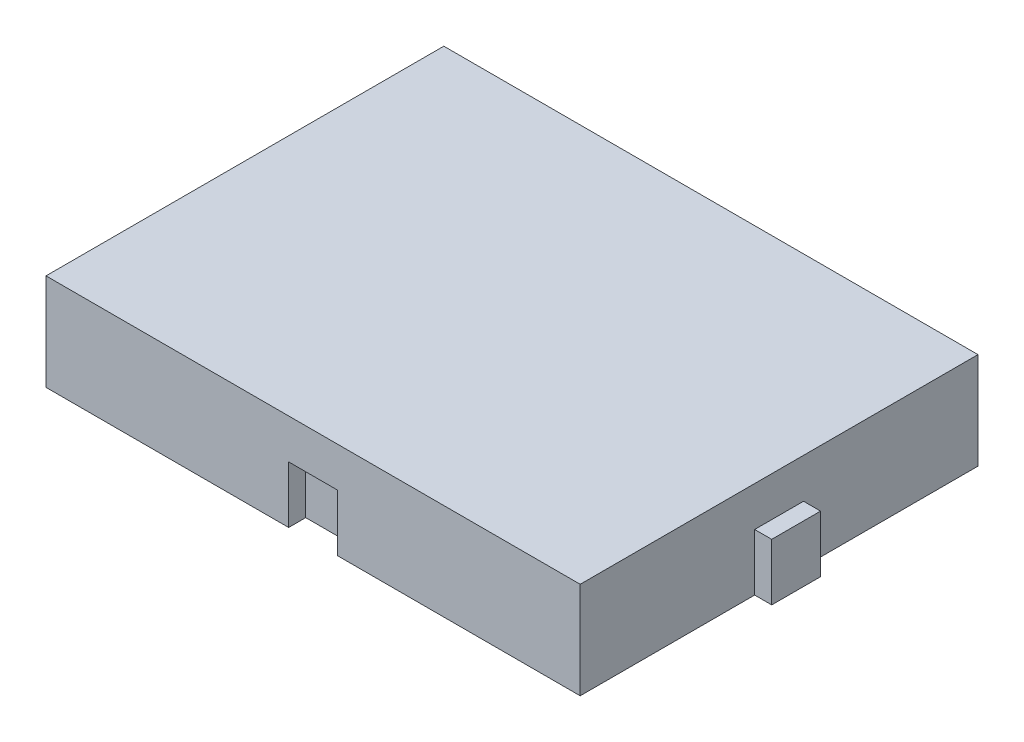
ISO-10303-21;
HEADER;
FILE_DESCRIPTION(('STEP AP214'),'2;1');
FILE_NAME('part.step','',(''),(''),'','','');
FILE_SCHEMA(('AUTOMOTIVE_DESIGN { 1 0 10303 214 1 1 1 1 }'));
ENDSEC;
DATA;
#1=APPLICATION_CONTEXT('core data for automotive mechanical design processes');
#2=APPLICATION_PROTOCOL_DEFINITION('international standard','automotive_design',2000,#1);
#3=PRODUCT_CONTEXT('',#1,'mechanical');
#4=PRODUCT('Part','Part','',(#3));
#5=PRODUCT_RELATED_PRODUCT_CATEGORY('part','',(#4));
#6=PRODUCT_DEFINITION_FORMATION('','',#4);
#7=PRODUCT_DEFINITION_CONTEXT('part definition',#1,'design');
#8=PRODUCT_DEFINITION('design','',#6,#7);
#9=PRODUCT_DEFINITION_SHAPE('','',#8);
#10=(LENGTH_UNIT() NAMED_UNIT(*) SI_UNIT(.MILLI.,.METRE.));
#11=(NAMED_UNIT(*) PLANE_ANGLE_UNIT() SI_UNIT($,.RADIAN.));
#12=(NAMED_UNIT(*) SI_UNIT($,.STERADIAN.) SOLID_ANGLE_UNIT());
#13=UNCERTAINTY_MEASURE_WITH_UNIT(LENGTH_MEASURE(1.E-05),#10,'distance_accuracy_value','');
#14=(GEOMETRIC_REPRESENTATION_CONTEXT(3) GLOBAL_UNCERTAINTY_ASSIGNED_CONTEXT((#13)) GLOBAL_UNIT_ASSIGNED_CONTEXT((#10,
#11,#12)) REPRESENTATION_CONTEXT('',''));
#15=CARTESIAN_POINT('',(0.,0.,0.));
#16=DIRECTION('',(0.,0.,1.));
#17=DIRECTION('',(1.,0.,0.));
#18=AXIS2_PLACEMENT_3D('',#15,#16,#17);
#19=CARTESIAN_POINT('',(23.5,8.5,17.5));
#20=DIRECTION('',(-1.,0.,0.));
#21=DIRECTION('',(0.,0.,1.));
#22=AXIS2_PLACEMENT_3D('',#19,#20,#21);
#23=PLANE('',#22);
#24=DIRECTION('',(0.,-1.,0.));
#25=VECTOR('',#24,1.);
#26=CARTESIAN_POINT('',(23.5,5.,2.15));
#27=LINE('',#26,#25);
#28=CARTESIAN_POINT('',(23.5,5.,2.15));
#29=VERTEX_POINT('',#28);
#30=CARTESIAN_POINT('',(23.5,0.,2.15));
#31=VERTEX_POINT('',#30);
#32=EDGE_CURVE('E258',#29,#31,#27,.T.);
#33=ORIENTED_EDGE('',*,*,#32,.F.);
#34=DIRECTION('',(0.,0.,-1.));
#35=VECTOR('',#34,1.);
#36=CARTESIAN_POINT('',(23.5,5.,2.15));
#37=LINE('',#36,#35);
#38=CARTESIAN_POINT('',(23.5,5.,-2.15));
#39=VERTEX_POINT('',#38);
#40=EDGE_CURVE('E237',#29,#39,#37,.T.);
#41=ORIENTED_EDGE('',*,*,#40,.T.);
#42=DIRECTION('',(0.,-1.,0.));
#43=VECTOR('',#42,1.);
#44=CARTESIAN_POINT('',(23.5,5.,-2.15));
#45=LINE('',#44,#43);
#46=CARTESIAN_POINT('',(23.5,0.,-2.15));
#47=VERTEX_POINT('',#46);
#48=EDGE_CURVE('E250',#39,#47,#45,.T.);
#49=ORIENTED_EDGE('',*,*,#48,.T.);
#50=DIRECTION('',(0.,0.,-1.));
#51=VECTOR('',#50,1.);
#52=CARTESIAN_POINT('',(23.5,0.,17.5));
#53=LINE('',#52,#51);
#54=CARTESIAN_POINT('',(23.5,0.,-17.5));
#55=VERTEX_POINT('',#54);
#56=EDGE_CURVE('E290',#47,#55,#53,.T.);
#57=ORIENTED_EDGE('',*,*,#56,.T.);
#58=DIRECTION('',(0.,-1.,0.));
#59=VECTOR('',#58,1.);
#60=CARTESIAN_POINT('',(23.5,8.5,-17.5));
#61=LINE('',#60,#59);
#62=CARTESIAN_POINT('',(23.5,8.5,-17.5));
#63=VERTEX_POINT('',#62);
#64=EDGE_CURVE('E11',#63,#55,#61,.T.);
#65=ORIENTED_EDGE('',*,*,#64,.F.);
#66=DIRECTION('',(0.,0.,-1.));
#67=VECTOR('',#66,1.);
#68=CARTESIAN_POINT('',(23.5,8.5,17.5));
#69=LINE('',#68,#67);
#70=CARTESIAN_POINT('',(23.5,8.5,17.5));
#71=VERTEX_POINT('',#70);
#72=EDGE_CURVE('E296',#71,#63,#69,.T.);
#73=ORIENTED_EDGE('',*,*,#72,.F.);
#74=DIRECTION('',(0.,-1.,0.));
#75=VECTOR('',#74,1.);
#76=CARTESIAN_POINT('',(23.5,8.5,17.5));
#77=LINE('',#76,#75);
#78=CARTESIAN_POINT('',(23.5,0.,17.5));
#79=VERTEX_POINT('',#78);
#80=EDGE_CURVE('E306',#71,#79,#77,.T.);
#81=ORIENTED_EDGE('',*,*,#80,.T.);
#82=EDGE_CURVE('E307',#79,#31,#53,.T.);
#83=ORIENTED_EDGE('',*,*,#82,.T.);
#84=EDGE_LOOP('',(#33,#41,#49,#57,#65,#73,#81,#83));
#85=FACE_BOUND('',#84,.T.);
#86=ADVANCED_FACE('F34',(#85),#23,.F.);
#87=CARTESIAN_POINT('',(-23.5,8.5,-17.5));
#88=DIRECTION('',(0.,0.,1.));
#89=DIRECTION('',(1.,0.,0.));
#90=AXIS2_PLACEMENT_3D('',#87,#88,#89);
#91=PLANE('',#90);
#92=DIRECTION('',(0.,-1.,0.));
#93=VECTOR('',#92,1.);
#94=CARTESIAN_POINT('',(2.15,5.,-17.5));
#95=LINE('',#94,#93);
#96=CARTESIAN_POINT('',(2.15,5.,-17.5));
#97=VERTEX_POINT('',#96);
#98=CARTESIAN_POINT('',(2.15,0.,-17.5));
#99=VERTEX_POINT('',#98);
#100=EDGE_CURVE('E291',#97,#99,#95,.T.);
#101=ORIENTED_EDGE('',*,*,#100,.F.);
#102=DIRECTION('',(-1.,0.,0.));
#103=VECTOR('',#102,1.);
#104=CARTESIAN_POINT('',(-2.15,5.,-17.5));
#105=LINE('',#104,#103);
#106=CARTESIAN_POINT('',(-2.15,5.,-17.5));
#107=VERTEX_POINT('',#106);
#108=EDGE_CURVE('E276',#97,#107,#105,.T.);
#109=ORIENTED_EDGE('',*,*,#108,.T.);
#110=DIRECTION('',(0.,-1.,0.));
#111=VECTOR('',#110,1.);
#112=CARTESIAN_POINT('',(-2.15,5.,-17.5));
#113=LINE('',#112,#111);
#114=CARTESIAN_POINT('',(-2.15,0.,-17.5));
#115=VERTEX_POINT('',#114);
#116=EDGE_CURVE('E287',#107,#115,#113,.T.);
#117=ORIENTED_EDGE('',*,*,#116,.T.);
#118=DIRECTION('',(-1.,0.,0.));
#119=VECTOR('',#118,1.);
#120=CARTESIAN_POINT('',(-23.5,0.,-17.5));
#121=LINE('',#120,#119);
#122=CARTESIAN_POINT('',(-23.5,0.,-17.5));
#123=VERTEX_POINT('',#122);
#124=EDGE_CURVE('E310',#115,#123,#121,.T.);
#125=ORIENTED_EDGE('',*,*,#124,.T.);
#126=DIRECTION('',(0.,-1.,0.));
#127=VECTOR('',#126,1.);
#128=CARTESIAN_POINT('',(-23.5,8.5,-17.5));
#129=LINE('',#128,#127);
#130=CARTESIAN_POINT('',(-23.5,8.5,-17.5));
#131=VERTEX_POINT('',#130);
#132=EDGE_CURVE('E41',#131,#123,#129,.T.);
#133=ORIENTED_EDGE('',*,*,#132,.F.);
#134=DIRECTION('',(-1.,0.,0.));
#135=VECTOR('',#134,1.);
#136=CARTESIAN_POINT('',(-23.5,8.5,-17.5));
#137=LINE('',#136,#135);
#138=EDGE_CURVE('E299',#63,#131,#137,.T.);
#139=ORIENTED_EDGE('',*,*,#138,.F.);
#140=ORIENTED_EDGE('',*,*,#64,.T.);
#141=EDGE_CURVE('E311',#55,#99,#121,.T.);
#142=ORIENTED_EDGE('',*,*,#141,.T.);
#143=EDGE_LOOP('',(#101,#109,#117,#125,#133,#139,#140,#142));
#144=FACE_BOUND('',#143,.T.);
#145=ADVANCED_FACE('F356',(#144),#91,.F.);
#146=CARTESIAN_POINT('',(-23.5,8.5,17.5));
#147=DIRECTION('',(1.,0.,0.));
#148=DIRECTION('',(0.,0.,-1.));
#149=AXIS2_PLACEMENT_3D('',#146,#147,#148);
#150=PLANE('',#149);
#151=DIRECTION('',(0.,0.,-1.));
#152=VECTOR('',#151,1.);
#153=CARTESIAN_POINT('',(-23.5,5.,2.15));
#154=LINE('',#153,#152);
#155=CARTESIAN_POINT('',(-23.5,5.,2.15));
#156=VERTEX_POINT('',#155);
#157=CARTESIAN_POINT('',(-23.5,5.,-2.15));
#158=VERTEX_POINT('',#157);
#159=EDGE_CURVE('E211',#156,#158,#154,.T.);
#160=ORIENTED_EDGE('',*,*,#159,.F.);
#161=DIRECTION('',(0.,-1.,0.));
#162=VECTOR('',#161,1.);
#163=CARTESIAN_POINT('',(-23.5,5.,2.15));
#164=LINE('',#163,#162);
#165=CARTESIAN_POINT('',(-23.5,0.,2.15));
#166=VERTEX_POINT('',#165);
#167=EDGE_CURVE('E201',#156,#166,#164,.T.);
#168=ORIENTED_EDGE('',*,*,#167,.T.);
#169=DIRECTION('',(0.,0.,1.));
#170=VECTOR('',#169,1.);
#171=CARTESIAN_POINT('',(-23.5,0.,17.5));
#172=LINE('',#171,#170);
#173=CARTESIAN_POINT('',(-23.5,0.,17.5));
#174=VERTEX_POINT('',#173);
#175=EDGE_CURVE('E314',#166,#174,#172,.T.);
#176=ORIENTED_EDGE('',*,*,#175,.T.);
#177=DIRECTION('',(0.,-1.,0.));
#178=VECTOR('',#177,1.);
#179=CARTESIAN_POINT('',(-23.5,8.5,17.5));
#180=LINE('',#179,#178);
#181=CARTESIAN_POINT('',(-23.5,8.5,17.5));
#182=VERTEX_POINT('',#181);
#183=EDGE_CURVE('E322',#182,#174,#180,.T.);
#184=ORIENTED_EDGE('',*,*,#183,.F.);
#185=DIRECTION('',(0.,0.,1.));
#186=VECTOR('',#185,1.);
#187=CARTESIAN_POINT('',(-23.5,8.5,17.5));
#188=LINE('',#187,#186);
#189=EDGE_CURVE('E302',#131,#182,#188,.T.);
#190=ORIENTED_EDGE('',*,*,#189,.F.);
#191=ORIENTED_EDGE('',*,*,#132,.T.);
#192=CARTESIAN_POINT('',(-23.5,0.,-2.15));
#193=VERTEX_POINT('',#192);
#194=EDGE_CURVE('E315',#123,#193,#172,.T.);
#195=ORIENTED_EDGE('',*,*,#194,.T.);
#196=DIRECTION('',(0.,-1.,0.));
#197=VECTOR('',#196,1.);
#198=CARTESIAN_POINT('',(-23.5,5.,-2.15));
#199=LINE('',#198,#197);
#200=EDGE_CURVE('E48',#158,#193,#199,.T.);
#201=ORIENTED_EDGE('',*,*,#200,.F.);
#202=EDGE_LOOP('',(#160,#168,#176,#184,#190,#191,#195,#201));
#203=FACE_BOUND('',#202,.T.);
#204=ADVANCED_FACE('F330',(#203),#150,.F.);
#205=CARTESIAN_POINT('',(-23.5,8.5,17.5));
#206=DIRECTION('',(0.,0.,-1.));
#207=DIRECTION('',(-1.,0.,0.));
#208=AXIS2_PLACEMENT_3D('',#205,#206,#207);
#209=PLANE('',#208);
#210=DIRECTION('',(-1.,0.,0.));
#211=VECTOR('',#210,1.);
#212=CARTESIAN_POINT('',(2.15,5.,17.5));
#213=LINE('',#212,#211);
#214=CARTESIAN_POINT('',(2.15,5.,17.5));
#215=VERTEX_POINT('',#214);
#216=CARTESIAN_POINT('',(-2.15,5.,17.5));
#217=VERTEX_POINT('',#216);
#218=EDGE_CURVE('E188',#215,#217,#213,.T.);
#219=ORIENTED_EDGE('',*,*,#218,.F.);
#220=DIRECTION('',(0.,-1.,0.));
#221=VECTOR('',#220,1.);
#222=CARTESIAN_POINT('',(2.15,5.,17.5));
#223=LINE('',#222,#221);
#224=CARTESIAN_POINT('',(2.15,0.,17.5));
#225=VERTEX_POINT('',#224);
#226=EDGE_CURVE('E172',#215,#225,#223,.T.);
#227=ORIENTED_EDGE('',*,*,#226,.T.);
#228=DIRECTION('',(1.,0.,0.));
#229=VECTOR('',#228,1.);
#230=CARTESIAN_POINT('',(-23.5,0.,17.5));
#231=LINE('',#230,#229);
#232=EDGE_CURVE('E318',#225,#79,#231,.T.);
#233=ORIENTED_EDGE('',*,*,#232,.T.);
#234=ORIENTED_EDGE('',*,*,#80,.F.);
#235=DIRECTION('',(1.,0.,0.));
#236=VECTOR('',#235,1.);
#237=CARTESIAN_POINT('',(-23.5,8.5,17.5));
#238=LINE('',#237,#236);
#239=EDGE_CURVE('E304',#182,#71,#238,.T.);
#240=ORIENTED_EDGE('',*,*,#239,.F.);
#241=ORIENTED_EDGE('',*,*,#183,.T.);
#242=CARTESIAN_POINT('',(-2.15,0.,17.5));
#243=VERTEX_POINT('',#242);
#244=EDGE_CURVE('E300',#174,#243,#231,.T.);
#245=ORIENTED_EDGE('',*,*,#244,.T.);
#246=DIRECTION('',(0.,-1.,0.));
#247=VECTOR('',#246,1.);
#248=CARTESIAN_POINT('',(-2.15,5.,17.5));
#249=LINE('',#248,#247);
#250=EDGE_CURVE('E56',#217,#243,#249,.T.);
#251=ORIENTED_EDGE('',*,*,#250,.F.);
#252=EDGE_LOOP('',(#219,#227,#233,#234,#240,#241,#245,#251));
#253=FACE_BOUND('',#252,.T.);
#254=ADVANCED_FACE('F192',(#253),#209,.F.);
#255=CARTESIAN_POINT('',(0.,8.5,0.));
#256=DIRECTION('',(0.,-1.,0.));
#257=DIRECTION('',(0.,0.,-1.));
#258=AXIS2_PLACEMENT_3D('',#255,#256,#257);
#259=PLANE('',#258);
#260=ORIENTED_EDGE('',*,*,#72,.T.);
#261=ORIENTED_EDGE('',*,*,#138,.T.);
#262=ORIENTED_EDGE('',*,*,#189,.T.);
#263=ORIENTED_EDGE('',*,*,#239,.T.);
#264=EDGE_LOOP('',(#260,#261,#262,#263));
#265=FACE_BOUND('',#264,.T.);
#266=ADVANCED_FACE('F353',(#265),#259,.F.);
#267=CARTESIAN_POINT('',(0.,0.,0.));
#268=DIRECTION('',(0.,-1.,0.));
#269=DIRECTION('',(0.,0.,-1.));
#270=AXIS2_PLACEMENT_3D('',#267,#268,#269);
#271=PLANE('',#270);
#272=DIRECTION('',(0.,0.,1.));
#273=VECTOR('',#272,1.);
#274=CARTESIAN_POINT('',(2.15,0.,16.));
#275=LINE('',#274,#273);
#276=CARTESIAN_POINT('',(2.15,0.,16.));
#277=VERTEX_POINT('',#276);
#278=EDGE_CURVE('E178',#277,#225,#275,.T.);
#279=ORIENTED_EDGE('',*,*,#278,.F.);
#280=DIRECTION('',(1.,0.,0.));
#281=VECTOR('',#280,1.);
#282=CARTESIAN_POINT('',(2.15,0.,16.));
#283=LINE('',#282,#281);
#284=CARTESIAN_POINT('',(-2.15,0.,16.));
#285=VERTEX_POINT('',#284);
#286=EDGE_CURVE('E190',#285,#277,#283,.T.);
#287=ORIENTED_EDGE('',*,*,#286,.F.);
#288=DIRECTION('',(0.,0.,-1.));
#289=VECTOR('',#288,1.);
#290=CARTESIAN_POINT('',(-2.15,0.,16.));
#291=LINE('',#290,#289);
#292=EDGE_CURVE('E200',#243,#285,#291,.T.);
#293=ORIENTED_EDGE('',*,*,#292,.F.);
#294=ORIENTED_EDGE('',*,*,#244,.F.);
#295=ORIENTED_EDGE('',*,*,#175,.F.);
#296=DIRECTION('',(-1.,0.,0.));
#297=VECTOR('',#296,1.);
#298=CARTESIAN_POINT('',(-23.5,0.,2.15));
#299=LINE('',#298,#297);
#300=CARTESIAN_POINT('',(-22.,0.,2.15));
#301=VERTEX_POINT('',#300);
#302=EDGE_CURVE('E215',#301,#166,#299,.T.);
#303=ORIENTED_EDGE('',*,*,#302,.F.);
#304=DIRECTION('',(0.,0.,1.));
#305=VECTOR('',#304,1.);
#306=CARTESIAN_POINT('',(-22.,0.,2.15));
#307=LINE('',#306,#305);
#308=CARTESIAN_POINT('',(-22.,0.,-2.15));
#309=VERTEX_POINT('',#308);
#310=EDGE_CURVE('E226',#309,#301,#307,.T.);
#311=ORIENTED_EDGE('',*,*,#310,.F.);
#312=DIRECTION('',(1.,0.,0.));
#313=VECTOR('',#312,1.);
#314=CARTESIAN_POINT('',(-23.5,0.,-2.15));
#315=LINE('',#314,#313);
#316=EDGE_CURVE('E224',#193,#309,#315,.T.);
#317=ORIENTED_EDGE('',*,*,#316,.F.);
#318=ORIENTED_EDGE('',*,*,#194,.F.);
#319=ORIENTED_EDGE('',*,*,#124,.F.);
#320=DIRECTION('',(0.,0.,-1.));
#321=VECTOR('',#320,1.);
#322=CARTESIAN_POINT('',(-2.15,0.,-19.));
#323=LINE('',#322,#321);
#324=CARTESIAN_POINT('',(-2.15,0.,-19.));
#325=VERTEX_POINT('',#324);
#326=EDGE_CURVE('E260',#115,#325,#323,.T.);
#327=ORIENTED_EDGE('',*,*,#326,.T.);
#328=DIRECTION('',(1.,0.,0.));
#329=VECTOR('',#328,1.);
#330=CARTESIAN_POINT('',(-2.15,0.,-19.));
#331=LINE('',#330,#329);
#332=CARTESIAN_POINT('',(2.15,0.,-19.));
#333=VERTEX_POINT('',#332);
#334=EDGE_CURVE('E282',#325,#333,#331,.T.);
#335=ORIENTED_EDGE('',*,*,#334,.T.);
#336=DIRECTION('',(0.,0.,1.));
#337=VECTOR('',#336,1.);
#338=CARTESIAN_POINT('',(2.15,0.,-19.));
#339=LINE('',#338,#337);
#340=EDGE_CURVE('E271',#333,#99,#339,.T.);
#341=ORIENTED_EDGE('',*,*,#340,.T.);
#342=ORIENTED_EDGE('',*,*,#141,.F.);
#343=ORIENTED_EDGE('',*,*,#56,.F.);
#344=DIRECTION('',(1.,0.,0.));
#345=VECTOR('',#344,1.);
#346=CARTESIAN_POINT('',(23.5,0.,-2.15));
#347=LINE('',#346,#345);
#348=CARTESIAN_POINT('',(25.,0.,-2.15));
#349=VERTEX_POINT('',#348);
#350=EDGE_CURVE('E207',#47,#349,#347,.T.);
#351=ORIENTED_EDGE('',*,*,#350,.T.);
#352=DIRECTION('',(0.,0.,1.));
#353=VECTOR('',#352,1.);
#354=CARTESIAN_POINT('',(25.,0.,2.15));
#355=LINE('',#354,#353);
#356=CARTESIAN_POINT('',(25.,0.,2.15));
#357=VERTEX_POINT('',#356);
#358=EDGE_CURVE('E253',#349,#357,#355,.T.);
#359=ORIENTED_EDGE('',*,*,#358,.T.);
#360=DIRECTION('',(-1.,0.,0.));
#361=VECTOR('',#360,1.);
#362=CARTESIAN_POINT('',(23.5,0.,2.15));
#363=LINE('',#362,#361);
#364=EDGE_CURVE('E241',#357,#31,#363,.T.);
#365=ORIENTED_EDGE('',*,*,#364,.T.);
#366=ORIENTED_EDGE('',*,*,#82,.F.);
#367=ORIENTED_EDGE('',*,*,#232,.F.);
#368=EDGE_LOOP('',(#279,#287,#293,#294,#295,#303,#311,#317,#318,#319,#327,#335,#341,#342,#343,
#351,#359,#365,#366,#367));
#369=FACE_BOUND('',#368,.T.);
#370=ADVANCED_FACE('F335',(#369),#271,.T.);
#371=CARTESIAN_POINT('',(-2.15,5.,-19.));
#372=DIRECTION('',(-1.,0.,0.));
#373=DIRECTION('',(0.,0.,1.));
#374=AXIS2_PLACEMENT_3D('',#371,#372,#373);
#375=PLANE('',#374);
#376=ORIENTED_EDGE('',*,*,#326,.F.);
#377=ORIENTED_EDGE('',*,*,#116,.F.);
#378=DIRECTION('',(0.,0.,-1.));
#379=VECTOR('',#378,1.);
#380=CARTESIAN_POINT('',(-2.15,5.,-19.));
#381=LINE('',#380,#379);
#382=CARTESIAN_POINT('',(-2.15,5.,-19.));
#383=VERTEX_POINT('',#382);
#384=EDGE_CURVE('E267',#107,#383,#381,.T.);
#385=ORIENTED_EDGE('',*,*,#384,.T.);
#386=DIRECTION('',(0.,-1.,0.));
#387=VECTOR('',#386,1.);
#388=CARTESIAN_POINT('',(-2.15,5.,-19.));
#389=LINE('',#388,#387);
#390=EDGE_CURVE('E279',#383,#325,#389,.T.);
#391=ORIENTED_EDGE('',*,*,#390,.T.);
#392=EDGE_LOOP('',(#376,#377,#385,#391));
#393=FACE_BOUND('',#392,.T.);
#394=ADVANCED_FACE('F372',(#393),#375,.T.);
#395=CARTESIAN_POINT('',(2.15,5.,-19.));
#396=DIRECTION('',(1.,0.,0.));
#397=DIRECTION('',(0.,0.,-1.));
#398=AXIS2_PLACEMENT_3D('',#395,#396,#397);
#399=PLANE('',#398);
#400=ORIENTED_EDGE('',*,*,#340,.F.);
#401=DIRECTION('',(0.,-1.,0.));
#402=VECTOR('',#401,1.);
#403=CARTESIAN_POINT('',(2.15,5.,-19.));
#404=LINE('',#403,#402);
#405=CARTESIAN_POINT('',(2.15,5.,-19.));
#406=VERTEX_POINT('',#405);
#407=EDGE_CURVE('E293',#406,#333,#404,.T.);
#408=ORIENTED_EDGE('',*,*,#407,.F.);
#409=DIRECTION('',(0.,0.,1.));
#410=VECTOR('',#409,1.);
#411=CARTESIAN_POINT('',(2.15,5.,-19.));
#412=LINE('',#411,#410);
#413=EDGE_CURVE('E274',#406,#97,#412,.T.);
#414=ORIENTED_EDGE('',*,*,#413,.T.);
#415=ORIENTED_EDGE('',*,*,#100,.T.);
#416=EDGE_LOOP('',(#400,#408,#414,#415));
#417=FACE_BOUND('',#416,.T.);
#418=ADVANCED_FACE('F364',(#417),#399,.T.);
#419=CARTESIAN_POINT('',(-2.15,5.,-19.));
#420=DIRECTION('',(0.,0.,-1.));
#421=DIRECTION('',(-1.,0.,0.));
#422=AXIS2_PLACEMENT_3D('',#419,#420,#421);
#423=PLANE('',#422);
#424=ORIENTED_EDGE('',*,*,#334,.F.);
#425=ORIENTED_EDGE('',*,*,#390,.F.);
#426=DIRECTION('',(1.,0.,0.));
#427=VECTOR('',#426,1.);
#428=CARTESIAN_POINT('',(-2.15,5.,-19.));
#429=LINE('',#428,#427);
#430=EDGE_CURVE('E270',#383,#406,#429,.T.);
#431=ORIENTED_EDGE('',*,*,#430,.T.);
#432=ORIENTED_EDGE('',*,*,#407,.T.);
#433=EDGE_LOOP('',(#424,#425,#431,#432));
#434=FACE_BOUND('',#433,.T.);
#435=ADVANCED_FACE('F374',(#434),#423,.T.);
#436=CARTESIAN_POINT('',(0.,5.,0.));
#437=DIRECTION('',(0.,1.,0.));
#438=DIRECTION('',(0.,0.,1.));
#439=AXIS2_PLACEMENT_3D('',#436,#437,#438);
#440=PLANE('',#439);
#441=ORIENTED_EDGE('',*,*,#384,.F.);
#442=ORIENTED_EDGE('',*,*,#108,.F.);
#443=ORIENTED_EDGE('',*,*,#413,.F.);
#444=ORIENTED_EDGE('',*,*,#430,.F.);
#445=EDGE_LOOP('',(#441,#442,#443,#444));
#446=FACE_BOUND('',#445,.T.);
#447=ADVANCED_FACE('F369',(#446),#440,.T.);
#448=CARTESIAN_POINT('',(23.5,5.,2.15));
#449=DIRECTION('',(0.,0.,1.));
#450=DIRECTION('',(1.,0.,0.));
#451=AXIS2_PLACEMENT_3D('',#448,#449,#450);
#452=PLANE('',#451);
#453=ORIENTED_EDGE('',*,*,#364,.F.);
#454=DIRECTION('',(0.,-1.,0.));
#455=VECTOR('',#454,1.);
#456=CARTESIAN_POINT('',(25.,5.,2.15));
#457=LINE('',#456,#455);
#458=CARTESIAN_POINT('',(25.,5.,2.15));
#459=VERTEX_POINT('',#458);
#460=EDGE_CURVE('E261',#459,#357,#457,.T.);
#461=ORIENTED_EDGE('',*,*,#460,.F.);
#462=DIRECTION('',(-1.,0.,0.));
#463=VECTOR('',#462,1.);
#464=CARTESIAN_POINT('',(23.5,5.,2.15));
#465=LINE('',#464,#463);
#466=EDGE_CURVE('E247',#459,#29,#465,.T.);
#467=ORIENTED_EDGE('',*,*,#466,.T.);
#468=ORIENTED_EDGE('',*,*,#32,.T.);
#469=EDGE_LOOP('',(#453,#461,#467,#468));
#470=FACE_BOUND('',#469,.T.);
#471=ADVANCED_FACE('F381',(#470),#452,.T.);
#472=CARTESIAN_POINT('',(25.,5.,2.15));
#473=DIRECTION('',(1.,0.,0.));
#474=DIRECTION('',(0.,0.,-1.));
#475=AXIS2_PLACEMENT_3D('',#472,#473,#474);
#476=PLANE('',#475);
#477=ORIENTED_EDGE('',*,*,#358,.F.);
#478=DIRECTION('',(0.,-1.,0.));
#479=VECTOR('',#478,1.);
#480=CARTESIAN_POINT('',(25.,5.,-2.15));
#481=LINE('',#480,#479);
#482=CARTESIAN_POINT('',(25.,5.,-2.15));
#483=VERTEX_POINT('',#482);
#484=EDGE_CURVE('E263',#483,#349,#481,.T.);
#485=ORIENTED_EDGE('',*,*,#484,.F.);
#486=DIRECTION('',(0.,0.,1.));
#487=VECTOR('',#486,1.);
#488=CARTESIAN_POINT('',(25.,5.,2.15));
#489=LINE('',#488,#487);
#490=EDGE_CURVE('E244',#483,#459,#489,.T.);
#491=ORIENTED_EDGE('',*,*,#490,.T.);
#492=ORIENTED_EDGE('',*,*,#460,.T.);
#493=EDGE_LOOP('',(#477,#485,#491,#492));
#494=FACE_BOUND('',#493,.T.);
#495=ADVANCED_FACE('F427',(#494),#476,.T.);
#496=CARTESIAN_POINT('',(23.5,5.,-2.15));
#497=DIRECTION('',(0.,0.,-1.));
#498=DIRECTION('',(-1.,0.,0.));
#499=AXIS2_PLACEMENT_3D('',#496,#497,#498);
#500=PLANE('',#499);
#501=ORIENTED_EDGE('',*,*,#350,.F.);
#502=ORIENTED_EDGE('',*,*,#48,.F.);
#503=DIRECTION('',(1.,0.,0.));
#504=VECTOR('',#503,1.);
#505=CARTESIAN_POINT('',(23.5,5.,-2.15));
#506=LINE('',#505,#504);
#507=EDGE_CURVE('E240',#39,#483,#506,.T.);
#508=ORIENTED_EDGE('',*,*,#507,.T.);
#509=ORIENTED_EDGE('',*,*,#484,.T.);
#510=EDGE_LOOP('',(#501,#502,#508,#509));
#511=FACE_BOUND('',#510,.T.);
#512=ADVANCED_FACE('F437',(#511),#500,.T.);
#513=CARTESIAN_POINT('',(0.,5.,0.));
#514=DIRECTION('',(0.,-1.,0.));
#515=DIRECTION('',(0.,0.,-1.));
#516=AXIS2_PLACEMENT_3D('',#513,#514,#515);
#517=PLANE('',#516);
#518=ORIENTED_EDGE('',*,*,#40,.F.);
#519=ORIENTED_EDGE('',*,*,#466,.F.);
#520=ORIENTED_EDGE('',*,*,#490,.F.);
#521=ORIENTED_EDGE('',*,*,#507,.F.);
#522=EDGE_LOOP('',(#518,#519,#520,#521));
#523=FACE_BOUND('',#522,.T.);
#524=ADVANCED_FACE('F447',(#523),#517,.F.);
#525=CARTESIAN_POINT('',(-23.5,5.,2.15));
#526=DIRECTION('',(0.,0.,1.));
#527=DIRECTION('',(1.,0.,0.));
#528=AXIS2_PLACEMENT_3D('',#525,#526,#527);
#529=PLANE('',#528);
#530=ORIENTED_EDGE('',*,*,#302,.T.);
#531=ORIENTED_EDGE('',*,*,#167,.F.);
#532=DIRECTION('',(-1.,0.,0.));
#533=VECTOR('',#532,1.);
#534=CARTESIAN_POINT('',(-23.5,5.,2.15));
#535=LINE('',#534,#533);
#536=CARTESIAN_POINT('',(-22.,5.,2.15));
#537=VERTEX_POINT('',#536);
#538=EDGE_CURVE('E221',#537,#156,#535,.T.);
#539=ORIENTED_EDGE('',*,*,#538,.F.);
#540=DIRECTION('',(0.,-1.,0.));
#541=VECTOR('',#540,1.);
#542=CARTESIAN_POINT('',(-22.,5.,2.15));
#543=LINE('',#542,#541);
#544=EDGE_CURVE('E232',#537,#301,#543,.T.);
#545=ORIENTED_EDGE('',*,*,#544,.T.);
#546=EDGE_LOOP('',(#530,#531,#539,#545));
#547=FACE_BOUND('',#546,.T.);
#548=ADVANCED_FACE('F457',(#547),#529,.F.);
#549=CARTESIAN_POINT('',(-22.,5.,2.15));
#550=DIRECTION('',(1.,0.,0.));
#551=DIRECTION('',(0.,0.,-1.));
#552=AXIS2_PLACEMENT_3D('',#549,#550,#551);
#553=PLANE('',#552);
#554=ORIENTED_EDGE('',*,*,#310,.T.);
#555=ORIENTED_EDGE('',*,*,#544,.F.);
#556=DIRECTION('',(0.,0.,1.));
#557=VECTOR('',#556,1.);
#558=CARTESIAN_POINT('',(-22.,5.,2.15));
#559=LINE('',#558,#557);
#560=CARTESIAN_POINT('',(-22.,5.,-2.15));
#561=VERTEX_POINT('',#560);
#562=EDGE_CURVE('E218',#561,#537,#559,.T.);
#563=ORIENTED_EDGE('',*,*,#562,.F.);
#564=DIRECTION('',(0.,-1.,0.));
#565=VECTOR('',#564,1.);
#566=CARTESIAN_POINT('',(-22.,5.,-2.15));
#567=LINE('',#566,#565);
#568=EDGE_CURVE('E234',#561,#309,#567,.T.);
#569=ORIENTED_EDGE('',*,*,#568,.T.);
#570=EDGE_LOOP('',(#554,#555,#563,#569));
#571=FACE_BOUND('',#570,.T.);
#572=ADVANCED_FACE('F341',(#571),#553,.F.);
#573=CARTESIAN_POINT('',(-23.5,5.,-2.15));
#574=DIRECTION('',(0.,0.,-1.));
#575=DIRECTION('',(-1.,0.,0.));
#576=AXIS2_PLACEMENT_3D('',#573,#574,#575);
#577=PLANE('',#576);
#578=ORIENTED_EDGE('',*,*,#316,.T.);
#579=ORIENTED_EDGE('',*,*,#568,.F.);
#580=DIRECTION('',(1.,0.,0.));
#581=VECTOR('',#580,1.);
#582=CARTESIAN_POINT('',(-23.5,5.,-2.15));
#583=LINE('',#582,#581);
#584=EDGE_CURVE('E214',#158,#561,#583,.T.);
#585=ORIENTED_EDGE('',*,*,#584,.F.);
#586=ORIENTED_EDGE('',*,*,#200,.T.);
#587=EDGE_LOOP('',(#578,#579,#585,#586));
#588=FACE_BOUND('',#587,.T.);
#589=ADVANCED_FACE('F338',(#588),#577,.F.);
#590=CARTESIAN_POINT('',(0.,5.,0.));
#591=DIRECTION('',(0.,-1.,0.));
#592=DIRECTION('',(0.,0.,-1.));
#593=AXIS2_PLACEMENT_3D('',#590,#591,#592);
#594=PLANE('',#593);
#595=ORIENTED_EDGE('',*,*,#159,.T.);
#596=ORIENTED_EDGE('',*,*,#584,.T.);
#597=ORIENTED_EDGE('',*,*,#562,.T.);
#598=ORIENTED_EDGE('',*,*,#538,.T.);
#599=EDGE_LOOP('',(#595,#596,#597,#598));
#600=FACE_BOUND('',#599,.T.);
#601=ADVANCED_FACE('F344',(#600),#594,.T.);
#602=CARTESIAN_POINT('',(2.15,5.,16.));
#603=DIRECTION('',(1.,0.,0.));
#604=DIRECTION('',(0.,0.,-1.));
#605=AXIS2_PLACEMENT_3D('',#602,#603,#604);
#606=PLANE('',#605);
#607=ORIENTED_EDGE('',*,*,#278,.T.);
#608=ORIENTED_EDGE('',*,*,#226,.F.);
#609=DIRECTION('',(0.,0.,1.));
#610=VECTOR('',#609,1.);
#611=CARTESIAN_POINT('',(2.15,5.,16.));
#612=LINE('',#611,#610);
#613=CARTESIAN_POINT('',(2.15,5.,16.));
#614=VERTEX_POINT('',#613);
#615=EDGE_CURVE('E175',#614,#215,#612,.T.);
#616=ORIENTED_EDGE('',*,*,#615,.F.);
#617=DIRECTION('',(0.,-1.,0.));
#618=VECTOR('',#617,1.);
#619=CARTESIAN_POINT('',(2.15,5.,16.));
#620=LINE('',#619,#618);
#621=EDGE_CURVE('E205',#614,#277,#620,.T.);
#622=ORIENTED_EDGE('',*,*,#621,.T.);
#623=EDGE_LOOP('',(#607,#608,#616,#622));
#624=FACE_BOUND('',#623,.T.);
#625=ADVANCED_FACE('F174',(#624),#606,.F.);
#626=CARTESIAN_POINT('',(2.15,5.,16.));
#627=DIRECTION('',(0.,0.,-1.));
#628=DIRECTION('',(-1.,0.,0.));
#629=AXIS2_PLACEMENT_3D('',#626,#627,#628);
#630=PLANE('',#629);
#631=ORIENTED_EDGE('',*,*,#286,.T.);
#632=ORIENTED_EDGE('',*,*,#621,.F.);
#633=DIRECTION('',(1.,0.,0.));
#634=VECTOR('',#633,1.);
#635=CARTESIAN_POINT('',(2.15,5.,16.));
#636=LINE('',#635,#634);
#637=CARTESIAN_POINT('',(-2.15,5.,16.));
#638=VERTEX_POINT('',#637);
#639=EDGE_CURVE('E182',#638,#614,#636,.T.);
#640=ORIENTED_EDGE('',*,*,#639,.F.);
#641=DIRECTION('',(0.,-1.,0.));
#642=VECTOR('',#641,1.);
#643=CARTESIAN_POINT('',(-2.15,5.,16.));
#644=LINE('',#643,#642);
#645=EDGE_CURVE('E208',#638,#285,#644,.T.);
#646=ORIENTED_EDGE('',*,*,#645,.T.);
#647=EDGE_LOOP('',(#631,#632,#640,#646));
#648=FACE_BOUND('',#647,.T.);
#649=ADVANCED_FACE('F517',(#648),#630,.F.);
#650=CARTESIAN_POINT('',(-2.15,5.,16.));
#651=DIRECTION('',(-1.,0.,0.));
#652=DIRECTION('',(0.,0.,1.));
#653=AXIS2_PLACEMENT_3D('',#650,#651,#652);
#654=PLANE('',#653);
#655=ORIENTED_EDGE('',*,*,#292,.T.);
#656=ORIENTED_EDGE('',*,*,#645,.F.);
#657=DIRECTION('',(0.,0.,-1.));
#658=VECTOR('',#657,1.);
#659=CARTESIAN_POINT('',(-2.15,5.,16.));
#660=LINE('',#659,#658);
#661=EDGE_CURVE('E194',#217,#638,#660,.T.);
#662=ORIENTED_EDGE('',*,*,#661,.F.);
#663=ORIENTED_EDGE('',*,*,#250,.T.);
#664=EDGE_LOOP('',(#655,#656,#662,#663));
#665=FACE_BOUND('',#664,.T.);
#666=ADVANCED_FACE('F526',(#665),#654,.F.);
#667=CARTESIAN_POINT('',(0.,5.,0.));
#668=DIRECTION('',(0.,-1.,0.));
#669=DIRECTION('',(0.,0.,-1.));
#670=AXIS2_PLACEMENT_3D('',#667,#668,#669);
#671=PLANE('',#670);
#672=ORIENTED_EDGE('',*,*,#615,.T.);
#673=ORIENTED_EDGE('',*,*,#218,.T.);
#674=ORIENTED_EDGE('',*,*,#661,.T.);
#675=ORIENTED_EDGE('',*,*,#639,.T.);
#676=EDGE_LOOP('',(#672,#673,#674,#675));
#677=FACE_BOUND('',#676,.T.);
#678=ADVANCED_FACE('F186',(#677),#671,.T.);
#679=CLOSED_SHELL('',(#86,#145,#204,#254,#266,#370,#394,#418,#435,#447,#471,#495,#512,#524,#548,
#572,#589,#601,#625,#649,#666,#678));
#680=MANIFOLD_SOLID_BREP('B2',#679);
#681=ADVANCED_BREP_SHAPE_REPRESENTATION('',(#18,#680),#14);
#682=SHAPE_DEFINITION_REPRESENTATION(#9,#681);
ENDSEC;
END-ISO-10303-21;
